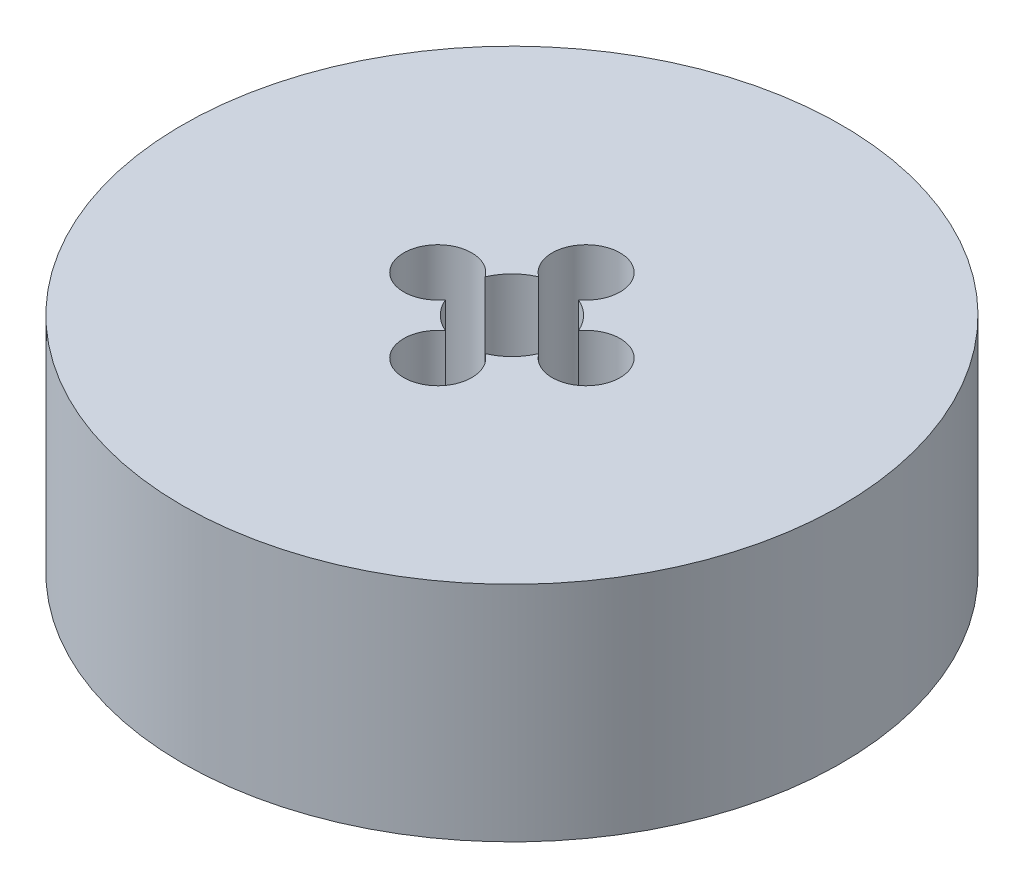
ISO-10303-21;
HEADER;
FILE_DESCRIPTION(('STEP AP214'),'2;1');
FILE_NAME('part.step','',(''),(''),'','','');
FILE_SCHEMA(('AUTOMOTIVE_DESIGN { 1 0 10303 214 1 1 1 1 }'));
ENDSEC;
DATA;
#1=APPLICATION_CONTEXT('core data for automotive mechanical design processes');
#2=APPLICATION_PROTOCOL_DEFINITION('international standard','automotive_design',2000,#1);
#3=PRODUCT_CONTEXT('',#1,'mechanical');
#4=PRODUCT('Part','Part','',(#3));
#5=PRODUCT_RELATED_PRODUCT_CATEGORY('part','',(#4));
#6=PRODUCT_DEFINITION_FORMATION('','',#4);
#7=PRODUCT_DEFINITION_CONTEXT('part definition',#1,'design');
#8=PRODUCT_DEFINITION('design','',#6,#7);
#9=PRODUCT_DEFINITION_SHAPE('','',#8);
#10=(LENGTH_UNIT() NAMED_UNIT(*) SI_UNIT(.MILLI.,.METRE.));
#11=(NAMED_UNIT(*) PLANE_ANGLE_UNIT() SI_UNIT($,.RADIAN.));
#12=(NAMED_UNIT(*) SI_UNIT($,.STERADIAN.) SOLID_ANGLE_UNIT());
#13=UNCERTAINTY_MEASURE_WITH_UNIT(LENGTH_MEASURE(1.E-05),#10,'distance_accuracy_value','');
#14=(GEOMETRIC_REPRESENTATION_CONTEXT(3) GLOBAL_UNCERTAINTY_ASSIGNED_CONTEXT((#13)) GLOBAL_UNIT_ASSIGNED_CONTEXT((#10,
#11,#12)) REPRESENTATION_CONTEXT('',''));
#15=CARTESIAN_POINT('',(0.,0.,0.));
#16=DIRECTION('',(0.,0.,1.));
#17=DIRECTION('',(1.,0.,0.));
#18=AXIS2_PLACEMENT_3D('',#15,#16,#17);
#19=CARTESIAN_POINT('',(0.,22.,0.));
#20=DIRECTION('',(0.,-1.,0.));
#21=DIRECTION('',(0.,0.,-1.));
#22=AXIS2_PLACEMENT_3D('',#19,#20,#21);
#23=CYLINDRICAL_SURFACE('',#22,32.5);
#24=CARTESIAN_POINT('',(0.,22.,0.));
#25=DIRECTION('',(0.,1.,0.));
#26=DIRECTION('',(0.,0.,1.));
#27=AXIS2_PLACEMENT_3D('',#24,#25,#26);
#28=CIRCLE('',#27,32.5);
#29=CARTESIAN_POINT('',(0.,22.,32.5));
#30=VERTEX_POINT('',#29);
#31=EDGE_CURVE('E145',#30,#30,#28,.T.);
#32=ORIENTED_EDGE('',*,*,#31,.F.);
#33=EDGE_LOOP('',(#32));
#34=FACE_BOUND('',#33,.T.);
#35=CARTESIAN_POINT('',(0.,0.,0.));
#36=DIRECTION('',(0.,1.,0.));
#37=DIRECTION('',(0.,0.,1.));
#38=AXIS2_PLACEMENT_3D('',#35,#36,#37);
#39=CIRCLE('',#38,32.5);
#40=CARTESIAN_POINT('',(0.,0.,32.5));
#41=VERTEX_POINT('',#40);
#42=EDGE_CURVE('E143',#41,#41,#39,.T.);
#43=ORIENTED_EDGE('',*,*,#42,.T.);
#44=EDGE_LOOP('',(#43));
#45=FACE_BOUND('',#44,.T.);
#46=ADVANCED_FACE('F39',(#34,#45),#23,.T.);
#47=CARTESIAN_POINT('',(0.,22.,0.));
#48=DIRECTION('',(0.,1.,0.));
#49=DIRECTION('',(0.,0.,1.));
#50=AXIS2_PLACEMENT_3D('',#47,#48,#49);
#51=PLANE('',#50);
#52=CARTESIAN_POINT('',(0.,22.,7.31567352306996));
#53=DIRECTION('',(0.,1.,0.));
#54=DIRECTION('',(1.,0.,0.));
#55=AXIS2_PLACEMENT_3D('',#52,#53,#54);
#56=CIRCLE('',#55,3.34925015455101);
#57=CARTESIAN_POINT('',(-1.96000790501921,22.,4.59982271530786));
#58=VERTEX_POINT('',#57);
#59=CARTESIAN_POINT('',(1.96000790501925,22.,4.59982271530785));
#60=VERTEX_POINT('',#59);
#61=EDGE_CURVE('E152',#58,#60,#56,.T.);
#62=ORIENTED_EDGE('',*,*,#61,.F.);
#63=CARTESIAN_POINT('',(0.,22.,0.));
#64=DIRECTION('',(0.,1.,0.));
#65=DIRECTION('',(0.,0.,1.));
#66=AXIS2_PLACEMENT_3D('',#63,#64,#65);
#67=CIRCLE('',#66,5.);
#68=CARTESIAN_POINT('',(-4.59982271530786,22.,1.96000790501923));
#69=VERTEX_POINT('',#68);
#70=EDGE_CURVE('E133',#69,#58,#67,.T.);
#71=ORIENTED_EDGE('',*,*,#70,.F.);
#72=CARTESIAN_POINT('',(-7.31567352306996,22.,0.));
#73=DIRECTION('',(0.,1.,0.));
#74=DIRECTION('',(0.,0.,1.));
#75=AXIS2_PLACEMENT_3D('',#72,#73,#74);
#76=CIRCLE('',#75,3.34925015455101);
#77=CARTESIAN_POINT('',(-4.59982271530786,22.,-1.96000790501923));
#78=VERTEX_POINT('',#77);
#79=EDGE_CURVE('E128',#78,#69,#76,.T.);
#80=ORIENTED_EDGE('',*,*,#79,.F.);
#81=CARTESIAN_POINT('',(-1.96000790501928,22.,-4.59982271530783));
#82=VERTEX_POINT('',#81);
#83=EDGE_CURVE('E121',#82,#78,#67,.T.);
#84=ORIENTED_EDGE('',*,*,#83,.F.);
#85=CARTESIAN_POINT('',(0.,22.,-7.31567352306996));
#86=DIRECTION('',(0.,1.,0.));
#87=DIRECTION('',(-1.,0.,0.));
#88=AXIS2_PLACEMENT_3D('',#85,#86,#87);
#89=CIRCLE('',#88,3.34925015455101);
#90=CARTESIAN_POINT('',(1.96000790501918,22.,-4.59982271530788));
#91=VERTEX_POINT('',#90);
#92=EDGE_CURVE('E105',#91,#82,#89,.T.);
#93=ORIENTED_EDGE('',*,*,#92,.F.);
#94=CARTESIAN_POINT('',(4.59982271530786,22.,-1.96000790501923));
#95=VERTEX_POINT('',#94);
#96=EDGE_CURVE('E131',#95,#91,#67,.T.);
#97=ORIENTED_EDGE('',*,*,#96,.F.);
#98=CARTESIAN_POINT('',(7.31567352306996,22.,0.));
#99=DIRECTION('',(0.,1.,0.));
#100=DIRECTION('',(0.,0.,-1.));
#101=AXIS2_PLACEMENT_3D('',#98,#99,#100);
#102=CIRCLE('',#101,3.34925015455101);
#103=CARTESIAN_POINT('',(4.59982271530786,22.,1.96000790501923));
#104=VERTEX_POINT('',#103);
#105=EDGE_CURVE('E154',#104,#95,#102,.T.);
#106=ORIENTED_EDGE('',*,*,#105,.F.);
#107=EDGE_CURVE('E134',#60,#104,#67,.T.);
#108=ORIENTED_EDGE('',*,*,#107,.F.);
#109=EDGE_LOOP('',(#62,#71,#80,#84,#93,#97,#106,#108));
#110=FACE_BOUND('',#109,.T.);
#111=ORIENTED_EDGE('',*,*,#31,.T.);
#112=EDGE_LOOP('',(#111));
#113=FACE_BOUND('',#112,.T.);
#114=ADVANCED_FACE('F130',(#110,#113),#51,.T.);
#115=CARTESIAN_POINT('',(0.,0.,0.));
#116=DIRECTION('',(0.,1.,0.));
#117=DIRECTION('',(0.,0.,1.));
#118=AXIS2_PLACEMENT_3D('',#115,#116,#117);
#119=PLANE('',#118);
#120=CARTESIAN_POINT('',(0.,0.,0.));
#121=DIRECTION('',(0.,1.,0.));
#122=DIRECTION('',(0.,0.,1.));
#123=AXIS2_PLACEMENT_3D('',#120,#121,#122);
#124=CIRCLE('',#123,5.);
#125=CARTESIAN_POINT('',(0.,0.,5.));
#126=VERTEX_POINT('',#125);
#127=EDGE_CURVE('E135',#126,#126,#124,.T.);
#128=ORIENTED_EDGE('',*,*,#127,.T.);
#129=EDGE_LOOP('',(#128));
#130=FACE_BOUND('',#129,.T.);
#131=ORIENTED_EDGE('',*,*,#42,.F.);
#132=EDGE_LOOP('',(#131));
#133=FACE_BOUND('',#132,.T.);
#134=ADVANCED_FACE('F195',(#130,#133),#119,.F.);
#135=CARTESIAN_POINT('',(0.,22.,0.));
#136=DIRECTION('',(0.,-1.,0.));
#137=DIRECTION('',(0.,0.,-1.));
#138=AXIS2_PLACEMENT_3D('',#135,#136,#137);
#139=CYLINDRICAL_SURFACE('',#138,5.);
#140=DIRECTION('',(0.,1.,0.));
#141=VECTOR('',#140,1.);
#142=CARTESIAN_POINT('',(-1.96000790501921,12.5975435526188,4.59982271530786));
#143=LINE('',#142,#141);
#144=CARTESIAN_POINT('',(-1.96000790501921,3.19508710523768,4.59982271530786));
#145=VERTEX_POINT('',#144);
#146=EDGE_CURVE('E11',#145,#58,#143,.T.);
#147=ORIENTED_EDGE('',*,*,#146,.F.);
#148=CARTESIAN_POINT('',(0.,3.19508710523768,0.));
#149=DIRECTION('',(0.,1.,0.));
#150=DIRECTION('',(0.,0.,1.));
#151=AXIS2_PLACEMENT_3D('',#148,#149,#150);
#152=CIRCLE('',#151,5.);
#153=CARTESIAN_POINT('',(1.96000790501925,3.19508710523768,4.59982271530785));
#154=VERTEX_POINT('',#153);
#155=EDGE_CURVE('E169',#145,#154,#152,.T.);
#156=ORIENTED_EDGE('',*,*,#155,.T.);
#157=DIRECTION('',(0.,1.,0.));
#158=VECTOR('',#157,1.);
#159=CARTESIAN_POINT('',(1.96000790501924,12.5975435526188,4.59982271530785));
#160=LINE('',#159,#158);
#161=EDGE_CURVE('E46',#60,#154,#160,.F.);
#162=ORIENTED_EDGE('',*,*,#161,.F.);
#163=ORIENTED_EDGE('',*,*,#107,.T.);
#164=DIRECTION('',(0.,1.,0.));
#165=VECTOR('',#164,1.);
#166=CARTESIAN_POINT('',(4.59982271530786,12.5975435526188,1.96000790501923));
#167=LINE('',#166,#165);
#168=CARTESIAN_POINT('',(4.59982271530786,3.19508710523768,1.96000790501923));
#169=VERTEX_POINT('',#168);
#170=EDGE_CURVE('E151',#169,#104,#167,.T.);
#171=ORIENTED_EDGE('',*,*,#170,.F.);
#172=CARTESIAN_POINT('',(0.,3.19508710523768,0.));
#173=DIRECTION('',(0.,1.,0.));
#174=DIRECTION('',(0.,0.,1.));
#175=AXIS2_PLACEMENT_3D('',#172,#173,#174);
#176=CIRCLE('',#175,5.);
#177=CARTESIAN_POINT('',(4.59982271530786,3.19508710523768,-1.96000790501923));
#178=VERTEX_POINT('',#177);
#179=EDGE_CURVE('E173',#169,#178,#176,.T.);
#180=ORIENTED_EDGE('',*,*,#179,.T.);
#181=DIRECTION('',(0.,1.,0.));
#182=VECTOR('',#181,1.);
#183=CARTESIAN_POINT('',(4.59982271530786,12.5975435526188,-1.96000790501923));
#184=LINE('',#183,#182);
#185=EDGE_CURVE('E168',#95,#178,#184,.F.);
#186=ORIENTED_EDGE('',*,*,#185,.F.);
#187=ORIENTED_EDGE('',*,*,#96,.T.);
#188=DIRECTION('',(0.,1.,0.));
#189=VECTOR('',#188,1.);
#190=CARTESIAN_POINT('',(1.96000790501918,12.5975435526188,-4.59982271530788));
#191=LINE('',#190,#189);
#192=CARTESIAN_POINT('',(1.96000790501918,3.19508710523768,-4.59982271530788));
#193=VERTEX_POINT('',#192);
#194=EDGE_CURVE('E108',#193,#91,#191,.T.);
#195=ORIENTED_EDGE('',*,*,#194,.F.);
#196=CARTESIAN_POINT('',(0.,3.19508710523768,0.));
#197=DIRECTION('',(0.,1.,0.));
#198=DIRECTION('',(0.,0.,1.));
#199=AXIS2_PLACEMENT_3D('',#196,#197,#198);
#200=CIRCLE('',#199,5.);
#201=CARTESIAN_POINT('',(-1.96000790501928,3.19508710523768,-4.59982271530783));
#202=VERTEX_POINT('',#201);
#203=EDGE_CURVE('E122',#193,#202,#200,.T.);
#204=ORIENTED_EDGE('',*,*,#203,.T.);
#205=DIRECTION('',(0.,1.,0.));
#206=VECTOR('',#205,1.);
#207=CARTESIAN_POINT('',(-1.96000790501928,12.5975435526188,-4.59982271530784));
#208=LINE('',#207,#206);
#209=EDGE_CURVE('E106',#82,#202,#208,.F.);
#210=ORIENTED_EDGE('',*,*,#209,.F.);
#211=ORIENTED_EDGE('',*,*,#83,.T.);
#212=DIRECTION('',(0.,1.,0.));
#213=VECTOR('',#212,1.);
#214=CARTESIAN_POINT('',(-4.59982271530786,12.5975435526188,-1.96000790501923));
#215=LINE('',#214,#213);
#216=CARTESIAN_POINT('',(-4.59982271530786,3.19508710523768,-1.96000790501923));
#217=VERTEX_POINT('',#216);
#218=EDGE_CURVE('E177',#217,#78,#215,.T.);
#219=ORIENTED_EDGE('',*,*,#218,.F.);
#220=CARTESIAN_POINT('',(0.,3.19508710523768,0.));
#221=DIRECTION('',(0.,1.,0.));
#222=DIRECTION('',(0.,0.,1.));
#223=AXIS2_PLACEMENT_3D('',#220,#221,#222);
#224=CIRCLE('',#223,5.);
#225=CARTESIAN_POINT('',(-4.59982271530786,3.19508710523768,1.96000790501923));
#226=VERTEX_POINT('',#225);
#227=EDGE_CURVE('E185',#217,#226,#224,.T.);
#228=ORIENTED_EDGE('',*,*,#227,.T.);
#229=DIRECTION('',(0.,1.,0.));
#230=VECTOR('',#229,1.);
#231=CARTESIAN_POINT('',(-4.59982271530786,12.5975435526188,1.96000790501923));
#232=LINE('',#231,#230);
#233=EDGE_CURVE('E179',#69,#226,#232,.F.);
#234=ORIENTED_EDGE('',*,*,#233,.F.);
#235=ORIENTED_EDGE('',*,*,#70,.T.);
#236=EDGE_LOOP('',(#147,#156,#162,#163,#171,#180,#186,#187,#195,#204,#210,#211,#219,#228,#234,#235));
#237=FACE_BOUND('',#236,.T.);
#238=ORIENTED_EDGE('',*,*,#127,.F.);
#239=EDGE_LOOP('',(#238));
#240=FACE_BOUND('',#239,.T.);
#241=ADVANCED_FACE('F117',(#237,#240),#139,.F.);
#242=CARTESIAN_POINT('',(-7.31567352306996,3.19508710523768,0.));
#243=DIRECTION('',(0.,1.,0.));
#244=DIRECTION('',(0.,0.,1.));
#245=AXIS2_PLACEMENT_3D('',#242,#243,#244);
#246=CYLINDRICAL_SURFACE('',#245,3.34925015455101);
#247=ORIENTED_EDGE('',*,*,#218,.T.);
#248=ORIENTED_EDGE('',*,*,#79,.T.);
#249=ORIENTED_EDGE('',*,*,#233,.T.);
#250=CARTESIAN_POINT('',(-7.31567352306996,3.19508710523768,0.));
#251=DIRECTION('',(0.,1.,0.));
#252=DIRECTION('',(0.,0.,1.));
#253=AXIS2_PLACEMENT_3D('',#250,#251,#252);
#254=CIRCLE('',#253,3.34925015455101);
#255=EDGE_CURVE('E140',#217,#226,#254,.T.);
#256=ORIENTED_EDGE('',*,*,#255,.F.);
#257=EDGE_LOOP('',(#247,#248,#249,#256));
#258=FACE_BOUND('',#257,.T.);
#259=ADVANCED_FACE('F200',(#258),#246,.F.);
#260=CARTESIAN_POINT('',(-7.31567352306996,3.19508710523768,0.));
#261=DIRECTION('',(0.,1.,0.));
#262=DIRECTION('',(0.,0.,1.));
#263=AXIS2_PLACEMENT_3D('',#260,#261,#262);
#264=PLANE('',#263);
#265=ORIENTED_EDGE('',*,*,#255,.T.);
#266=ORIENTED_EDGE('',*,*,#227,.F.);
#267=EDGE_LOOP('',(#265,#266));
#268=FACE_BOUND('',#267,.T.);
#269=ADVANCED_FACE('F202',(#268),#264,.T.);
#270=CARTESIAN_POINT('',(0.,3.19508710523768,-7.31567352306996));
#271=DIRECTION('',(0.,1.,0.));
#272=DIRECTION('',(0.,0.,1.));
#273=AXIS2_PLACEMENT_3D('',#270,#271,#272);
#274=CYLINDRICAL_SURFACE('',#273,3.34925015455101);
#275=ORIENTED_EDGE('',*,*,#194,.T.);
#276=ORIENTED_EDGE('',*,*,#92,.T.);
#277=ORIENTED_EDGE('',*,*,#209,.T.);
#278=CARTESIAN_POINT('',(0.,3.19508710523768,-7.31567352306996));
#279=DIRECTION('',(0.,1.,0.));
#280=DIRECTION('',(-1.,0.,0.));
#281=AXIS2_PLACEMENT_3D('',#278,#279,#280);
#282=CIRCLE('',#281,3.34925015455101);
#283=EDGE_CURVE('E111',#193,#202,#282,.T.);
#284=ORIENTED_EDGE('',*,*,#283,.F.);
#285=EDGE_LOOP('',(#275,#276,#277,#284));
#286=FACE_BOUND('',#285,.T.);
#287=ADVANCED_FACE('F102',(#286),#274,.F.);
#288=CARTESIAN_POINT('',(0.,3.19508710523768,-7.31567352306996));
#289=DIRECTION('',(0.,1.,0.));
#290=DIRECTION('',(-1.,0.,0.));
#291=AXIS2_PLACEMENT_3D('',#288,#289,#290);
#292=PLANE('',#291);
#293=ORIENTED_EDGE('',*,*,#283,.T.);
#294=ORIENTED_EDGE('',*,*,#203,.F.);
#295=EDGE_LOOP('',(#293,#294));
#296=FACE_BOUND('',#295,.T.);
#297=ADVANCED_FACE('F211',(#296),#292,.T.);
#298=CARTESIAN_POINT('',(7.31567352306996,3.19508710523768,0.));
#299=DIRECTION('',(0.,1.,0.));
#300=DIRECTION('',(0.,0.,1.));
#301=AXIS2_PLACEMENT_3D('',#298,#299,#300);
#302=CYLINDRICAL_SURFACE('',#301,3.34925015455101);
#303=ORIENTED_EDGE('',*,*,#170,.T.);
#304=ORIENTED_EDGE('',*,*,#105,.T.);
#305=ORIENTED_EDGE('',*,*,#185,.T.);
#306=CARTESIAN_POINT('',(7.31567352306996,3.19508710523768,0.));
#307=DIRECTION('',(0.,1.,0.));
#308=DIRECTION('',(0.,0.,-1.));
#309=AXIS2_PLACEMENT_3D('',#306,#307,#308);
#310=CIRCLE('',#309,3.34925015455101);
#311=EDGE_CURVE('E56',#169,#178,#310,.T.);
#312=ORIENTED_EDGE('',*,*,#311,.F.);
#313=EDGE_LOOP('',(#303,#304,#305,#312));
#314=FACE_BOUND('',#313,.T.);
#315=ADVANCED_FACE('F212',(#314),#302,.F.);
#316=CARTESIAN_POINT('',(7.31567352306996,3.19508710523768,0.));
#317=DIRECTION('',(0.,1.,0.));
#318=DIRECTION('',(0.,0.,-1.));
#319=AXIS2_PLACEMENT_3D('',#316,#317,#318);
#320=PLANE('',#319);
#321=ORIENTED_EDGE('',*,*,#311,.T.);
#322=ORIENTED_EDGE('',*,*,#179,.F.);
#323=EDGE_LOOP('',(#321,#322));
#324=FACE_BOUND('',#323,.T.);
#325=ADVANCED_FACE('F217',(#324),#320,.T.);
#326=CARTESIAN_POINT('',(0.,3.19508710523768,7.31567352306996));
#327=DIRECTION('',(0.,1.,0.));
#328=DIRECTION('',(0.,0.,1.));
#329=AXIS2_PLACEMENT_3D('',#326,#327,#328);
#330=CYLINDRICAL_SURFACE('',#329,3.34925015455101);
#331=ORIENTED_EDGE('',*,*,#146,.T.);
#332=ORIENTED_EDGE('',*,*,#61,.T.);
#333=ORIENTED_EDGE('',*,*,#161,.T.);
#334=CARTESIAN_POINT('',(0.,3.19508710523768,7.31567352306996));
#335=DIRECTION('',(0.,1.,0.));
#336=DIRECTION('',(1.,0.,0.));
#337=AXIS2_PLACEMENT_3D('',#334,#335,#336);
#338=CIRCLE('',#337,3.34925015455101);
#339=EDGE_CURVE('E55',#145,#154,#338,.T.);
#340=ORIENTED_EDGE('',*,*,#339,.F.);
#341=EDGE_LOOP('',(#331,#332,#333,#340));
#342=FACE_BOUND('',#341,.T.);
#343=ADVANCED_FACE('F170',(#342),#330,.F.);
#344=CARTESIAN_POINT('',(0.,3.19508710523768,7.31567352306996));
#345=DIRECTION('',(0.,1.,0.));
#346=DIRECTION('',(1.,0.,0.));
#347=AXIS2_PLACEMENT_3D('',#344,#345,#346);
#348=PLANE('',#347);
#349=ORIENTED_EDGE('',*,*,#339,.T.);
#350=ORIENTED_EDGE('',*,*,#155,.F.);
#351=EDGE_LOOP('',(#349,#350));
#352=FACE_BOUND('',#351,.T.);
#353=ADVANCED_FACE('F224',(#352),#348,.T.);
#354=CLOSED_SHELL('',(#46,#114,#134,#241,#259,#269,#287,#297,#315,#325,#343,#353));
#355=MANIFOLD_SOLID_BREP('B2',#354);
#356=ADVANCED_BREP_SHAPE_REPRESENTATION('',(#18,#355),#14);
#357=SHAPE_DEFINITION_REPRESENTATION(#9,#356);
ENDSEC;
END-ISO-10303-21;
